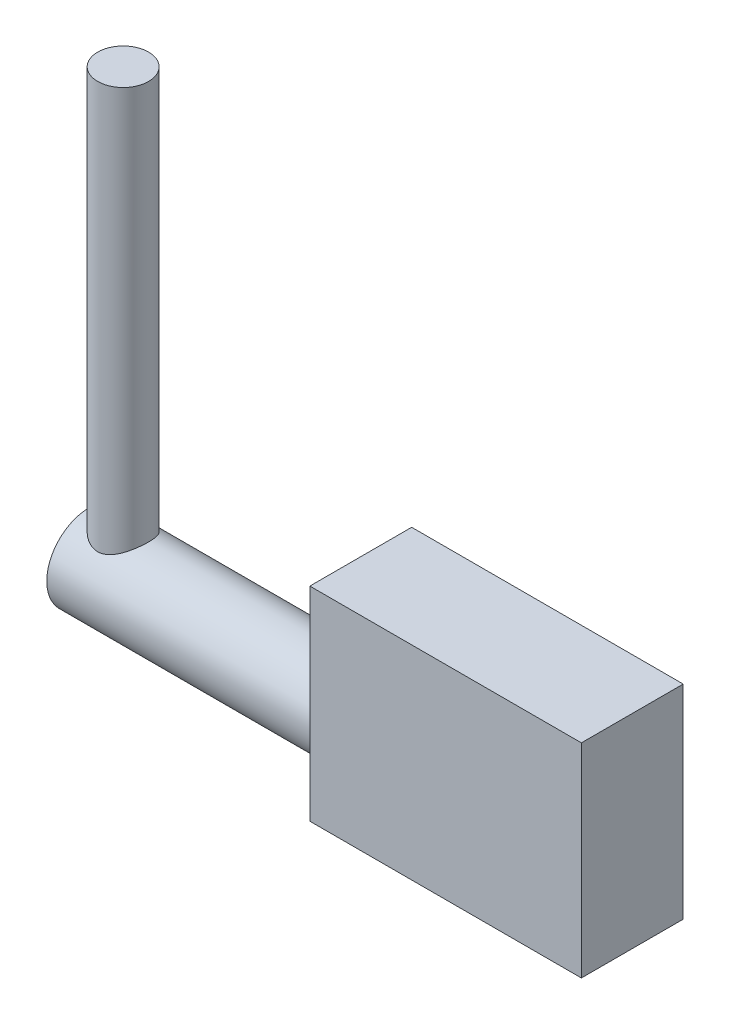
ISO-10303-21;
HEADER;
FILE_DESCRIPTION(('STEP AP214'),'2;1');
FILE_NAME('part.step','',(''),(''),'','','');
FILE_SCHEMA(('AUTOMOTIVE_DESIGN { 1 0 10303 214 1 1 1 1 }'));
ENDSEC;
DATA;
#1=APPLICATION_CONTEXT('core data for automotive mechanical design processes');
#2=APPLICATION_PROTOCOL_DEFINITION('international standard','automotive_design',2000,#1);
#3=PRODUCT_CONTEXT('',#1,'mechanical');
#4=PRODUCT('Part','Part','',(#3));
#5=PRODUCT_RELATED_PRODUCT_CATEGORY('part','',(#4));
#6=PRODUCT_DEFINITION_FORMATION('','',#4);
#7=PRODUCT_DEFINITION_CONTEXT('part definition',#1,'design');
#8=PRODUCT_DEFINITION('design','',#6,#7);
#9=PRODUCT_DEFINITION_SHAPE('','',#8);
#10=(LENGTH_UNIT() NAMED_UNIT(*) SI_UNIT(.MILLI.,.METRE.));
#11=(NAMED_UNIT(*) PLANE_ANGLE_UNIT() SI_UNIT($,.RADIAN.));
#12=(NAMED_UNIT(*) SI_UNIT($,.STERADIAN.) SOLID_ANGLE_UNIT());
#13=UNCERTAINTY_MEASURE_WITH_UNIT(LENGTH_MEASURE(1.E-05),#10,'distance_accuracy_value','');
#14=(GEOMETRIC_REPRESENTATION_CONTEXT(3) GLOBAL_UNCERTAINTY_ASSIGNED_CONTEXT((#13)) GLOBAL_UNIT_ASSIGNED_CONTEXT((#10,
#11,#12)) REPRESENTATION_CONTEXT('',''));
#15=CARTESIAN_POINT('',(0.,0.,0.));
#16=DIRECTION('',(0.,0.,1.));
#17=DIRECTION('',(1.,0.,0.));
#18=AXIS2_PLACEMENT_3D('',#15,#16,#17);
#19=CARTESIAN_POINT('',(-25.4,6.35,4.7625));
#20=DIRECTION('',(1.,0.,0.));
#21=DIRECTION('',(0.,0.,-1.));
#22=AXIS2_PLACEMENT_3D('',#19,#20,#21);
#23=CYLINDRICAL_SURFACE('',#22,3.96875);
#24=CARTESIAN_POINT('',(0.,6.35,4.7625));
#25=DIRECTION('',(1.,0.,0.));
#26=DIRECTION('',(0.,1.,0.));
#27=AXIS2_PLACEMENT_3D('',#24,#25,#26);
#28=CIRCLE('',#27,3.96875);
#29=CARTESIAN_POINT('',(0.,10.31875,4.7625));
#30=VERTEX_POINT('',#29);
#31=EDGE_CURVE('E372',#30,#30,#28,.F.);
#32=ORIENTED_EDGE('',*,*,#31,.T.);
#33=EDGE_LOOP('',(#32));
#34=FACE_BOUND('',#33,.T.);
#35=CARTESIAN_POINT('',(-25.4,6.35,4.7625));
#36=DIRECTION('',(-1.,0.,0.));
#37=DIRECTION('',(0.,0.,1.));
#38=AXIS2_PLACEMENT_3D('',#35,#36,#37);
#39=CIRCLE('',#38,3.96875);
#40=CARTESIAN_POINT('',(-25.4,6.35,8.73125));
#41=VERTEX_POINT('',#40);
#42=EDGE_CURVE('E426',#41,#41,#39,.T.);
#43=ORIENTED_EDGE('',*,*,#42,.F.);
#44=EDGE_LOOP('',(#43));
#45=FACE_BOUND('',#44,.T.);
#46=CARTESIAN_POINT('',(-22.225,9.525,2.38125));
#47=CARTESIAN_POINT('',(-22.3447347207475,9.52501620784583,2.38126068586411));
#48=CARTESIAN_POINT('',(-22.4645911374267,9.53189076425156,2.3903532948817));
#49=CARTESIAN_POINT('',(-22.7002003488857,9.55821304283393,2.4260928399506));
#50=CARTESIAN_POINT('',(-22.8159487280329,9.57767388625493,2.45275809609317));
#51=CARTESIAN_POINT('',(-23.0395140081775,9.62600394421508,2.52184837143669));
#52=CARTESIAN_POINT('',(-23.1473815930622,9.65480506192768,2.56415962493724));
#53=CARTESIAN_POINT('',(-23.3544086455601,9.71845075278641,2.6629847379494));
#54=CARTESIAN_POINT('',(-23.4535655037402,9.7532971276462,2.71950283389457));
#55=CARTESIAN_POINT('',(-23.6536685290762,9.83025409400087,2.85319333128232));
#56=CARTESIAN_POINT('',(-23.7533511255777,9.87273193188991,2.93204617934199));
#57=CARTESIAN_POINT('',(-23.9391267048173,9.9572163505197,3.10472450130582));
#58=CARTESIAN_POINT('',(-24.0252094061699,9.9992225526346,3.19856119611429));
#59=CARTESIAN_POINT('',(-24.1905373781593,10.0834121527203,3.41083525040672));
#60=CARTESIAN_POINT('',(-24.2680401991292,10.125124749008,3.5308349599945));
#61=CARTESIAN_POINT('',(-24.4011604463161,10.198795114901,3.78514891030583));
#62=CARTESIAN_POINT('',(-24.4567979494675,10.2307618271886,3.91944987476514));
#63=CARTESIAN_POINT('',(-24.5389335247083,10.2786019321303,4.18501289233021));
#64=CARTESIAN_POINT('',(-24.5677060723006,10.2957202002468,4.31534141685951));
#65=CARTESIAN_POINT('',(-24.6029842002795,10.3167646608187,4.57998431621275));
#66=CARTESIAN_POINT('',(-24.6095106902595,10.3207032411093,4.71429482840439));
#67=CARTESIAN_POINT('',(-24.6005131759323,10.3153110418412,4.96512418796396));
#68=CARTESIAN_POINT('',(-24.5876230271637,10.3075650705382,5.08178408468132));
#69=CARTESIAN_POINT('',(-24.5451633244511,10.2823644611597,5.31092452727131));
#70=CARTESIAN_POINT('',(-24.5155925360558,10.2649091045421,5.42340476317129));
#71=CARTESIAN_POINT('',(-24.4408871691993,10.2216729018129,5.64206513899215));
#72=CARTESIAN_POINT('',(-24.3956632654507,10.195844328341,5.74820492950492));
#73=CARTESIAN_POINT('',(-24.2913144217331,10.1379279975809,5.95151949795084));
#74=CARTESIAN_POINT('',(-24.2321858714998,10.1058386150776,6.04869193842193));
#75=CARTESIAN_POINT('',(-24.0937429402253,10.0336020745978,6.24375539901093));
#76=CARTESIAN_POINT('',(-24.0128610553241,9.99295027827041,6.34034587752435));
#77=CARTESIAN_POINT('',(-23.8372584631027,9.91005692253521,6.51940952099644));
#78=CARTESIAN_POINT('',(-23.742519025788,9.8678132698538,6.60186324567027));
#79=CARTESIAN_POINT('',(-23.528887717653,9.78076331794018,6.7599692996706));
#80=CARTESIAN_POINT('',(-23.4084692222407,9.73622737457491,6.83372606445284));
#81=CARTESIAN_POINT('',(-23.1541538572798,9.65598271288571,6.95955582287528));
#82=CARTESIAN_POINT('',(-23.0202823881,9.62025778349672,7.01166876092986));
#83=CARTESIAN_POINT('',(-22.7768251094041,9.57097185999589,7.08148026606981));
#84=CARTESIAN_POINT('',(-22.6694354963639,9.55411298175935,7.10450546562127));
#85=CARTESIAN_POINT('',(-22.4514193935149,9.53122539365007,7.13550885445804));
#86=CARTESIAN_POINT('',(-22.3407968207303,9.52518408855049,7.14350454359656));
#87=CARTESIAN_POINT('',(-22.1193492046345,9.52482401462767,7.14398465215246));
#88=CARTESIAN_POINT('',(-22.0085240930418,9.53052148646831,7.13644758190644));
#89=CARTESIAN_POINT('',(-21.7900450899267,9.55280539335794,7.1062896055403));
#90=CARTESIAN_POINT('',(-21.6823937753277,9.56940043523978,7.08365677666219));
#91=CARTESIAN_POINT('',(-21.472978112058,9.61122931916184,7.02450199017831));
#92=CARTESIAN_POINT('',(-21.3712065905485,9.63645236406268,6.9879973855023));
#93=CARTESIAN_POINT('',(-21.174904100225,9.69282319991929,6.90239054220083));
#94=CARTESIAN_POINT('',(-21.0803758801486,9.72397322461947,6.85328355158026));
#95=CARTESIAN_POINT('',(-20.8831814837884,9.79545945305639,6.73365855270094));
#96=CARTESIAN_POINT('',(-20.7821203884803,9.83643934259368,6.6608765948624));
#97=CARTESIAN_POINT('',(-20.5925963281591,9.91904556554685,6.5006105833306));
#98=CARTESIAN_POINT('',(-20.5041455692159,9.96067248261287,6.41311246138325));
#99=CARTESIAN_POINT('',(-20.3307588596266,10.0462646787062,6.21233152786488));
#100=CARTESIAN_POINT('',(-20.2477754010115,10.0898302101366,6.09717533921927));
#101=CARTESIAN_POINT('',(-20.102659042462,10.1685385133133,5.85165811392643));
#102=CARTESIAN_POINT('',(-20.0405123176085,10.2036868653137,5.72130723646224));
#103=CARTESIAN_POINT('',(-19.9671841849618,10.245896651761,5.52221522854625));
#104=CARTESIAN_POINT('',(-19.9465349682027,10.2579176982529,5.45787606735232));
#105=CARTESIAN_POINT('',(-19.9106936245967,10.2789215372481,5.32722593717038));
#106=CARTESIAN_POINT('',(-19.8954984396536,10.287906032192,5.26091609580692));
#107=CARTESIAN_POINT('',(-19.8708159045828,10.3025572832343,5.12692510358438));
#108=CARTESIAN_POINT('',(-19.8613246680655,10.3082262982668,5.05924491898419));
#109=CARTESIAN_POINT('',(-19.848189830187,10.3160845734442,4.92314272384808));
#110=CARTESIAN_POINT('',(-19.8445454665317,10.3182742872075,4.85472081118722));
#111=CARTESIAN_POINT('',(-19.8426955582115,10.319379954953,4.66763131684825));
#112=CARTESIAN_POINT('',(-19.8504166276393,10.3147306291584,4.54881202611821));
#113=CARTESIAN_POINT('',(-19.8832645248985,10.2951469597601,4.31456664706954));
#114=CARTESIAN_POINT('',(-19.9083915466044,10.2802125015965,4.19914059656111));
#115=CARTESIAN_POINT('',(-19.9742747365273,10.2417461413424,3.97646235903023));
#116=CARTESIAN_POINT('',(-20.0147742571752,10.2183557037008,3.86910889872845));
#117=CARTESIAN_POINT('',(-20.1098790954575,10.1648157522186,3.66270705610435));
#118=CARTESIAN_POINT('',(-20.1644875762772,10.1346647228747,3.56366054277847));
#119=CARTESIAN_POINT('',(-20.2928940007388,10.0662331769596,3.36508195064245));
#120=CARTESIAN_POINT('',(-20.3681315816967,10.0274254602797,3.26666446377696));
#121=CARTESIAN_POINT('',(-20.5323323091909,9.94730522750099,3.08308755936047));
#122=CARTESIAN_POINT('',(-20.6213106611464,9.90598996769813,2.9979430418926));
#123=CARTESIAN_POINT('',(-20.8236933957177,9.81913493817352,2.83224332452806));
#124=CARTESIAN_POINT('',(-20.9387644083279,9.77372385998186,2.75363937044672));
#125=CARTESIAN_POINT('',(-21.1827720974943,9.68972512891919,2.61688545059814));
#126=CARTESIAN_POINT('',(-21.3117015194731,9.65113393369388,2.55872485061302));
#127=CARTESIAN_POINT('',(-21.5694991702628,9.58977431933933,2.46956100045838));
#128=CARTESIAN_POINT('',(-21.6974315391945,9.56593575791118,2.43666207335965));
#129=CARTESIAN_POINT('',(-21.8932682665361,9.54162018222261,2.40353711830243));
#130=CARTESIAN_POINT('',(-21.9591774985188,9.53542222102569,2.39519946399233));
#131=CARTESIAN_POINT('',(-22.0917119735161,9.52710787485344,2.3840532780635));
#132=CARTESIAN_POINT('',(-22.158337125358,9.52499097620483,2.38124405059438));
#133=CARTESIAN_POINT('',(-22.225,9.525,2.38125));
#134=B_SPLINE_CURVE_WITH_KNOTS('',3,(#46,#47,#48,#49,#50,#51,#52,#53,#54,#55,#56,#57,#58,#59,
#60,#61,#62,#63,#64,#65,#66,#67,#68,#69,#70,#71,#72,#73,#74,#75,#76,#77,#78,#79,#80,#81,#82,#83,
#84,#85,#86,#87,#88,#89,#90,#91,#92,#93,#94,#95,#96,#97,#98,#99,#100,#101,#102,#103,#104,#105,
#106,#107,#108,#109,#110,#111,#112,#113,#114,#115,#116,#117,#118,#119,#120,#121,#122,#123,#124,
#125,#126,#127,#128,#129,#130,#131,#132,#133),.UNSPECIFIED.,.T.,.F.,(4,2,2,2,2,2,2,2,2,2,2,2,2,
2,2,2,2,2,2,2,2,2,2,2,2,2,2,2,2,2,2,2,2,2,2,2,2,2,2,2,2,2,2,4),(0.,0.358910333570759,
0.718195436750097,1.07491787970453,1.43174682256767,1.83220459049115,2.23296366660415,
2.67700375411242,3.12063516198049,3.52192162742852,3.9228308101188,4.27402832242289,
4.625251828521,4.97851358625236,5.33186716790582,5.72742710967026,6.1235267207041,
6.56552965437757,7.00671319248262,7.33863623164379,7.67017255087381,8.00216786045318,
8.3344256937287,8.66626924932791,8.99823811785592,9.39005358592746,9.78224577043364,
10.2254340197096,10.6683276343851,10.8739691881023,11.0794952570362,11.2848811313883,
11.4902402260977,11.8457822637211,12.2013282615788,12.5511823061084,12.9011148550009,
13.28903632571,13.6773901843904,14.1149924496567,14.5523667450582,14.9523736864948,
15.152223876205,15.352048909622),.UNSPECIFIED.);
#135=CARTESIAN_POINT('',(-22.225,9.525,2.38125));
#136=VERTEX_POINT('',#135);
#137=EDGE_CURVE('E11',#136,#136,#134,.T.);
#138=ORIENTED_EDGE('',*,*,#137,.F.);
#139=EDGE_LOOP('',(#138));
#140=FACE_BOUND('',#139,.T.);
#141=ADVANCED_FACE('F360',(#34,#45,#140),#23,.T.);
#142=CARTESIAN_POINT('',(0.,19.05,9.525));
#143=DIRECTION('',(1.,0.,0.));
#144=DIRECTION('',(0.,1.,0.));
#145=AXIS2_PLACEMENT_3D('',#142,#143,#144);
#146=PLANE('',#145);
#147=DIRECTION('',(0.,-1.,0.));
#148=VECTOR('',#147,1.);
#149=CARTESIAN_POINT('',(0.,19.05,0.));
#150=LINE('',#149,#148);
#151=CARTESIAN_POINT('',(0.,19.05,0.));
#152=VERTEX_POINT('',#151);
#153=CARTESIAN_POINT('',(0.,0.,0.));
#154=VERTEX_POINT('',#153);
#155=EDGE_CURVE('E411',#152,#154,#150,.T.);
#156=ORIENTED_EDGE('',*,*,#155,.T.);
#157=DIRECTION('',(0.,0.,-1.));
#158=VECTOR('',#157,1.);
#159=CARTESIAN_POINT('',(0.,0.,9.525));
#160=LINE('',#159,#158);
#161=CARTESIAN_POINT('',(0.,0.,9.525));
#162=VERTEX_POINT('',#161);
#163=EDGE_CURVE('E442',#162,#154,#160,.T.);
#164=ORIENTED_EDGE('',*,*,#163,.F.);
#165=DIRECTION('',(0.,-1.,0.));
#166=VECTOR('',#165,1.);
#167=CARTESIAN_POINT('',(0.,19.05,9.525));
#168=LINE('',#167,#166);
#169=CARTESIAN_POINT('',(0.,19.05,9.525));
#170=VERTEX_POINT('',#169);
#171=EDGE_CURVE('E384',#170,#162,#168,.T.);
#172=ORIENTED_EDGE('',*,*,#171,.F.);
#173=DIRECTION('',(0.,0.,-1.));
#174=VECTOR('',#173,1.);
#175=CARTESIAN_POINT('',(0.,19.05,9.525));
#176=LINE('',#175,#174);
#177=EDGE_CURVE('E422',#170,#152,#176,.T.);
#178=ORIENTED_EDGE('',*,*,#177,.T.);
#179=EDGE_LOOP('',(#156,#164,#172,#178));
#180=FACE_BOUND('',#179,.T.);
#181=ORIENTED_EDGE('',*,*,#31,.F.);
#182=EDGE_LOOP('',(#181));
#183=FACE_BOUND('',#182,.T.);
#184=ADVANCED_FACE('F450',(#180,#183),#146,.F.);
#185=CARTESIAN_POINT('',(25.4,19.05,9.525));
#186=DIRECTION('',(-1.,0.,0.));
#187=DIRECTION('',(0.,-1.,0.));
#188=AXIS2_PLACEMENT_3D('',#185,#186,#187);
#189=PLANE('',#188);
#190=DIRECTION('',(0.,1.,0.));
#191=VECTOR('',#190,1.);
#192=CARTESIAN_POINT('',(25.4,19.05,0.));
#193=LINE('',#192,#191);
#194=CARTESIAN_POINT('',(25.4,0.,0.));
#195=VERTEX_POINT('',#194);
#196=CARTESIAN_POINT('',(25.4,19.05,0.));
#197=VERTEX_POINT('',#196);
#198=EDGE_CURVE('E410',#195,#197,#193,.T.);
#199=ORIENTED_EDGE('',*,*,#198,.T.);
#200=DIRECTION('',(0.,0.,-1.));
#201=VECTOR('',#200,1.);
#202=CARTESIAN_POINT('',(25.4,19.05,9.525));
#203=LINE('',#202,#201);
#204=CARTESIAN_POINT('',(25.4,19.05,9.525));
#205=VERTEX_POINT('',#204);
#206=EDGE_CURVE('E417',#205,#197,#203,.T.);
#207=ORIENTED_EDGE('',*,*,#206,.F.);
#208=DIRECTION('',(0.,1.,0.));
#209=VECTOR('',#208,1.);
#210=CARTESIAN_POINT('',(25.4,19.05,9.525));
#211=LINE('',#210,#209);
#212=CARTESIAN_POINT('',(25.4,0.,9.525));
#213=VERTEX_POINT('',#212);
#214=EDGE_CURVE('E436',#213,#205,#211,.T.);
#215=ORIENTED_EDGE('',*,*,#214,.F.);
#216=DIRECTION('',(0.,0.,-1.));
#217=VECTOR('',#216,1.);
#218=CARTESIAN_POINT('',(25.4,0.,9.525));
#219=LINE('',#218,#217);
#220=EDGE_CURVE('E425',#213,#195,#219,.T.);
#221=ORIENTED_EDGE('',*,*,#220,.T.);
#222=EDGE_LOOP('',(#199,#207,#215,#221));
#223=FACE_BOUND('',#222,.T.);
#224=ADVANCED_FACE('F362',(#223),#189,.F.);
#225=CARTESIAN_POINT('',(25.4,19.05,9.525));
#226=DIRECTION('',(0.,-1.,0.));
#227=DIRECTION('',(1.,0.,0.));
#228=AXIS2_PLACEMENT_3D('',#225,#226,#227);
#229=PLANE('',#228);
#230=DIRECTION('',(-1.,0.,0.));
#231=VECTOR('',#230,1.);
#232=CARTESIAN_POINT('',(25.4,19.05,0.));
#233=LINE('',#232,#231);
#234=EDGE_CURVE('E405',#197,#152,#233,.T.);
#235=ORIENTED_EDGE('',*,*,#234,.T.);
#236=ORIENTED_EDGE('',*,*,#177,.F.);
#237=DIRECTION('',(-1.,0.,0.));
#238=VECTOR('',#237,1.);
#239=CARTESIAN_POINT('',(25.4,19.05,9.525));
#240=LINE('',#239,#238);
#241=EDGE_CURVE('E419',#205,#170,#240,.T.);
#242=ORIENTED_EDGE('',*,*,#241,.F.);
#243=ORIENTED_EDGE('',*,*,#206,.T.);
#244=EDGE_LOOP('',(#235,#236,#242,#243));
#245=FACE_BOUND('',#244,.T.);
#246=ADVANCED_FACE('F418',(#245),#229,.F.);
#247=CARTESIAN_POINT('',(0.,0.,9.525));
#248=DIRECTION('',(0.,1.,0.));
#249=DIRECTION('',(-1.,0.,0.));
#250=AXIS2_PLACEMENT_3D('',#247,#248,#249);
#251=PLANE('',#250);
#252=DIRECTION('',(1.,0.,0.));
#253=VECTOR('',#252,1.);
#254=CARTESIAN_POINT('',(0.,0.,0.));
#255=LINE('',#254,#253);
#256=EDGE_CURVE('E434',#154,#195,#255,.T.);
#257=ORIENTED_EDGE('',*,*,#256,.T.);
#258=ORIENTED_EDGE('',*,*,#220,.F.);
#259=DIRECTION('',(1.,0.,0.));
#260=VECTOR('',#259,1.);
#261=CARTESIAN_POINT('',(0.,0.,9.525));
#262=LINE('',#261,#260);
#263=EDGE_CURVE('E379',#162,#213,#262,.T.);
#264=ORIENTED_EDGE('',*,*,#263,.F.);
#265=ORIENTED_EDGE('',*,*,#163,.T.);
#266=EDGE_LOOP('',(#257,#258,#264,#265));
#267=FACE_BOUND('',#266,.T.);
#268=ADVANCED_FACE('F461',(#267),#251,.F.);
#269=CARTESIAN_POINT('',(25.4,19.05,9.525));
#270=DIRECTION('',(0.,0.,-1.));
#271=DIRECTION('',(-1.,0.,0.));
#272=AXIS2_PLACEMENT_3D('',#269,#270,#271);
#273=PLANE('',#272);
#274=ORIENTED_EDGE('',*,*,#214,.T.);
#275=ORIENTED_EDGE('',*,*,#241,.T.);
#276=ORIENTED_EDGE('',*,*,#171,.T.);
#277=ORIENTED_EDGE('',*,*,#263,.T.);
#278=EDGE_LOOP('',(#274,#275,#276,#277));
#279=FACE_BOUND('',#278,.T.);
#280=ADVANCED_FACE('F467',(#279),#273,.F.);
#281=CARTESIAN_POINT('',(25.4,19.05,0.));
#282=DIRECTION('',(0.,0.,-1.));
#283=DIRECTION('',(-1.,0.,0.));
#284=AXIS2_PLACEMENT_3D('',#281,#282,#283);
#285=PLANE('',#284);
#286=ORIENTED_EDGE('',*,*,#198,.F.);
#287=ORIENTED_EDGE('',*,*,#256,.F.);
#288=ORIENTED_EDGE('',*,*,#155,.F.);
#289=ORIENTED_EDGE('',*,*,#234,.F.);
#290=EDGE_LOOP('',(#286,#287,#288,#289));
#291=FACE_BOUND('',#290,.T.);
#292=ADVANCED_FACE('F407',(#291),#285,.T.);
#293=CARTESIAN_POINT('',(-25.4,6.35,4.7625));
#294=DIRECTION('',(-1.,0.,0.));
#295=DIRECTION('',(0.,0.,1.));
#296=AXIS2_PLACEMENT_3D('',#293,#294,#295);
#297=PLANE('',#296);
#298=ORIENTED_EDGE('',*,*,#42,.T.);
#299=EDGE_LOOP('',(#298));
#300=FACE_BOUND('',#299,.T.);
#301=ADVANCED_FACE('F474',(#300),#297,.T.);
#302=CARTESIAN_POINT('',(-22.225,47.625,4.7625));
#303=DIRECTION('',(0.,-1.,0.));
#304=DIRECTION('',(0.,0.,-1.));
#305=AXIS2_PLACEMENT_3D('',#302,#303,#304);
#306=CYLINDRICAL_SURFACE('',#305,2.38125);
#307=CARTESIAN_POINT('',(-22.225,47.625,4.7625));
#308=DIRECTION('',(0.,1.,0.));
#309=DIRECTION('',(0.,0.,1.));
#310=AXIS2_PLACEMENT_3D('',#307,#308,#309);
#311=CIRCLE('',#310,2.38125);
#312=CARTESIAN_POINT('',(-22.225,47.625,7.14375));
#313=VERTEX_POINT('',#312);
#314=EDGE_CURVE('E429',#313,#313,#311,.T.);
#315=ORIENTED_EDGE('',*,*,#314,.F.);
#316=EDGE_LOOP('',(#315));
#317=FACE_BOUND('',#316,.T.);
#318=ORIENTED_EDGE('',*,*,#137,.T.);
#319=EDGE_LOOP('',(#318));
#320=FACE_BOUND('',#319,.T.);
#321=ADVANCED_FACE('F478',(#317,#320),#306,.T.);
#322=CARTESIAN_POINT('',(-22.225,47.625,4.7625));
#323=DIRECTION('',(0.,1.,0.));
#324=DIRECTION('',(0.,0.,1.));
#325=AXIS2_PLACEMENT_3D('',#322,#323,#324);
#326=PLANE('',#325);
#327=ORIENTED_EDGE('',*,*,#314,.T.);
#328=EDGE_LOOP('',(#327));
#329=FACE_BOUND('',#328,.T.);
#330=ADVANCED_FACE('F483',(#329),#326,.T.);
#331=CLOSED_SHELL('',(#141,#184,#224,#246,#268,#280,#292,#301,#321,#330));
#332=MANIFOLD_SOLID_BREP('B2',#331);
#333=ADVANCED_BREP_SHAPE_REPRESENTATION('',(#18,#332),#14);
#334=SHAPE_DEFINITION_REPRESENTATION(#9,#333);
ENDSEC;
END-ISO-10303-21;
